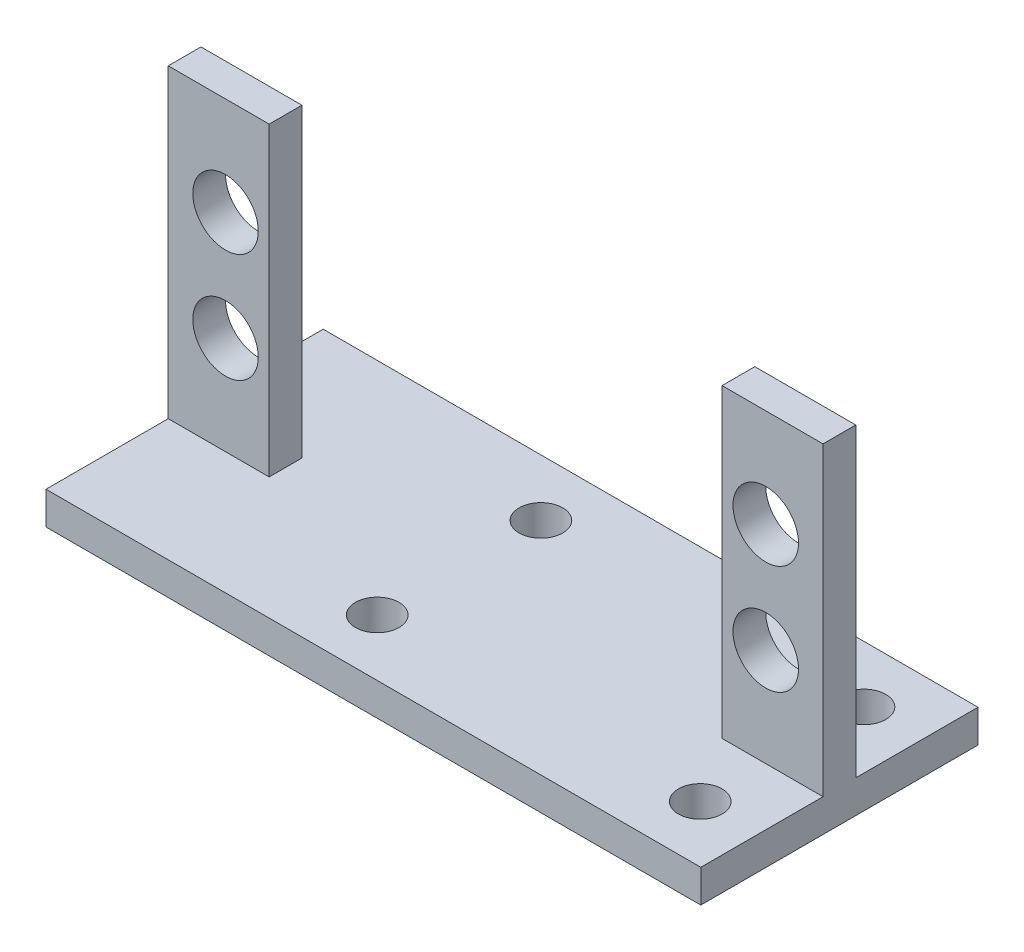
ISO-10303-21;
HEADER;
FILE_DESCRIPTION(('STEP AP214'),'2;1');
FILE_NAME('part.step','',(''),(''),'','','');
FILE_SCHEMA(('AUTOMOTIVE_DESIGN { 1 0 10303 214 1 1 1 1 }'));
ENDSEC;
DATA;
#1=APPLICATION_CONTEXT('core data for automotive mechanical design processes');
#2=APPLICATION_PROTOCOL_DEFINITION('international standard','automotive_design',2000,#1);
#3=PRODUCT_CONTEXT('',#1,'mechanical');
#4=PRODUCT('Part','Part','',(#3));
#5=PRODUCT_RELATED_PRODUCT_CATEGORY('part','',(#4));
#6=PRODUCT_DEFINITION_FORMATION('','',#4);
#7=PRODUCT_DEFINITION_CONTEXT('part definition',#1,'design');
#8=PRODUCT_DEFINITION('design','',#6,#7);
#9=PRODUCT_DEFINITION_SHAPE('','',#8);
#10=(LENGTH_UNIT() NAMED_UNIT(*) SI_UNIT(.MILLI.,.METRE.));
#11=(NAMED_UNIT(*) PLANE_ANGLE_UNIT() SI_UNIT($,.RADIAN.));
#12=(NAMED_UNIT(*) SI_UNIT($,.STERADIAN.) SOLID_ANGLE_UNIT());
#13=UNCERTAINTY_MEASURE_WITH_UNIT(LENGTH_MEASURE(1.E-05),#10,'distance_accuracy_value','');
#14=(GEOMETRIC_REPRESENTATION_CONTEXT(3) GLOBAL_UNCERTAINTY_ASSIGNED_CONTEXT((#13)) GLOBAL_UNIT_ASSIGNED_CONTEXT((#10,
#11,#12)) REPRESENTATION_CONTEXT('',''));
#15=CARTESIAN_POINT('',(0.,0.,0.));
#16=DIRECTION('',(0.,0.,1.));
#17=DIRECTION('',(1.,0.,0.));
#18=AXIS2_PLACEMENT_3D('',#15,#16,#17);
#19=CARTESIAN_POINT('',(-29.,3.,-12.7));
#20=DIRECTION('',(0.,0.,1.));
#21=DIRECTION('',(1.,0.,0.));
#22=AXIS2_PLACEMENT_3D('',#19,#20,#21);
#23=PLANE('',#22);
#24=DIRECTION('',(-1.,0.,0.));
#25=VECTOR('',#24,1.);
#26=CARTESIAN_POINT('',(-29.,0.,-12.7));
#27=LINE('',#26,#25);
#28=CARTESIAN_POINT('',(30.,0.,-12.7));
#29=VERTEX_POINT('',#28);
#30=CARTESIAN_POINT('',(-30.,0.,-12.7));
#31=VERTEX_POINT('',#30);
#32=EDGE_CURVE('E121',#29,#31,#27,.T.);
#33=ORIENTED_EDGE('',*,*,#32,.T.);
#34=DIRECTION('',(0.,-1.,0.));
#35=VECTOR('',#34,1.);
#36=CARTESIAN_POINT('',(-30.,0.,-12.7));
#37=LINE('',#36,#35);
#38=CARTESIAN_POINT('',(-30.,3.,-12.7));
#39=VERTEX_POINT('',#38);
#40=EDGE_CURVE('E204',#39,#31,#37,.T.);
#41=ORIENTED_EDGE('',*,*,#40,.F.);
#42=DIRECTION('',(-1.,0.,0.));
#43=VECTOR('',#42,1.);
#44=CARTESIAN_POINT('',(-29.,3.,-12.7));
#45=LINE('',#44,#43);
#46=CARTESIAN_POINT('',(30.,3.,-12.7));
#47=VERTEX_POINT('',#46);
#48=EDGE_CURVE('E48',#47,#39,#45,.T.);
#49=ORIENTED_EDGE('',*,*,#48,.F.);
#50=DIRECTION('',(0.,1.,0.));
#51=VECTOR('',#50,1.);
#52=CARTESIAN_POINT('',(30.,3.,-12.7));
#53=LINE('',#52,#51);
#54=EDGE_CURVE('E207',#29,#47,#53,.T.);
#55=ORIENTED_EDGE('',*,*,#54,.F.);
#56=EDGE_LOOP('',(#33,#41,#49,#55));
#57=FACE_BOUND('',#56,.T.);
#58=ADVANCED_FACE('F39',(#57),#23,.F.);
#59=CARTESIAN_POINT('',(0.,3.,0.));
#60=DIRECTION('',(0.,1.,0.));
#61=DIRECTION('',(0.,0.,1.));
#62=AXIS2_PLACEMENT_3D('',#59,#60,#61);
#63=PLANE('',#62);
#64=DIRECTION('',(0.,0.,-1.));
#65=VECTOR('',#64,1.);
#66=CARTESIAN_POINT('',(-20.75,3.,-1.5));
#67=LINE('',#66,#65);
#68=CARTESIAN_POINT('',(-20.75,3.,1.5));
#69=VERTEX_POINT('',#68);
#70=CARTESIAN_POINT('',(-20.75,3.,-1.5));
#71=VERTEX_POINT('',#70);
#72=EDGE_CURVE('E99',#69,#71,#67,.T.);
#73=ORIENTED_EDGE('',*,*,#72,.F.);
#74=DIRECTION('',(1.,0.,0.));
#75=VECTOR('',#74,1.);
#76=CARTESIAN_POINT('',(-20.75,3.,1.5));
#77=LINE('',#76,#75);
#78=CARTESIAN_POINT('',(-30.,3.,1.5));
#79=VERTEX_POINT('',#78);
#80=EDGE_CURVE('E79',#79,#69,#77,.T.);
#81=ORIENTED_EDGE('',*,*,#80,.F.);
#82=DIRECTION('',(0.,0.,-1.));
#83=VECTOR('',#82,1.);
#84=CARTESIAN_POINT('',(-30.,3.,1.5));
#85=LINE('',#84,#83);
#86=CARTESIAN_POINT('',(-30.,3.,12.7));
#87=VERTEX_POINT('',#86);
#88=EDGE_CURVE('E230',#87,#79,#85,.T.);
#89=ORIENTED_EDGE('',*,*,#88,.F.);
#90=DIRECTION('',(1.,0.,0.));
#91=VECTOR('',#90,1.);
#92=CARTESIAN_POINT('',(-29.,3.,12.7));
#93=LINE('',#92,#91);
#94=CARTESIAN_POINT('',(30.,3.,12.7));
#95=VERTEX_POINT('',#94);
#96=EDGE_CURVE('E11',#87,#95,#93,.T.);
#97=ORIENTED_EDGE('',*,*,#96,.T.);
#98=DIRECTION('',(0.,0.,1.));
#99=VECTOR('',#98,1.);
#100=CARTESIAN_POINT('',(30.,3.,12.7));
#101=LINE('',#100,#99);
#102=CARTESIAN_POINT('',(30.,3.,1.5));
#103=VERTEX_POINT('',#102);
#104=EDGE_CURVE('E269',#103,#95,#101,.T.);
#105=ORIENTED_EDGE('',*,*,#104,.F.);
#106=DIRECTION('',(1.,0.,0.));
#107=VECTOR('',#106,1.);
#108=CARTESIAN_POINT('',(20.75,3.,1.5));
#109=LINE('',#108,#107);
#110=CARTESIAN_POINT('',(20.75,3.,1.5));
#111=VERTEX_POINT('',#110);
#112=EDGE_CURVE('E299',#111,#103,#109,.T.);
#113=ORIENTED_EDGE('',*,*,#112,.F.);
#114=DIRECTION('',(0.,0.,1.));
#115=VECTOR('',#114,1.);
#116=CARTESIAN_POINT('',(20.75,3.,-1.5));
#117=LINE('',#116,#115);
#118=CARTESIAN_POINT('',(20.75,3.,-1.5));
#119=VERTEX_POINT('',#118);
#120=EDGE_CURVE('E305',#119,#111,#117,.T.);
#121=ORIENTED_EDGE('',*,*,#120,.F.);
#122=DIRECTION('',(-1.,0.,0.));
#123=VECTOR('',#122,1.);
#124=CARTESIAN_POINT('',(28.75,3.,-1.5));
#125=LINE('',#124,#123);
#126=CARTESIAN_POINT('',(30.,3.,-1.5));
#127=VERTEX_POINT('',#126);
#128=EDGE_CURVE('E56',#127,#119,#125,.T.);
#129=ORIENTED_EDGE('',*,*,#128,.F.);
#130=DIRECTION('',(0.,0.,1.));
#131=VECTOR('',#130,1.);
#132=CARTESIAN_POINT('',(30.,3.,-1.5));
#133=LINE('',#132,#131);
#134=EDGE_CURVE('E253',#47,#127,#133,.T.);
#135=ORIENTED_EDGE('',*,*,#134,.F.);
#136=ORIENTED_EDGE('',*,*,#48,.T.);
#137=DIRECTION('',(0.,0.,-1.));
#138=VECTOR('',#137,1.);
#139=CARTESIAN_POINT('',(-30.,3.,-12.7));
#140=LINE('',#139,#138);
#141=CARTESIAN_POINT('',(-30.,3.,-1.5));
#142=VERTEX_POINT('',#141);
#143=EDGE_CURVE('E224',#142,#39,#140,.T.);
#144=ORIENTED_EDGE('',*,*,#143,.F.);
#145=DIRECTION('',(-1.,0.,0.));
#146=VECTOR('',#145,1.);
#147=CARTESIAN_POINT('',(-28.75,3.,-1.5));
#148=LINE('',#147,#146);
#149=EDGE_CURVE('E93',#71,#142,#148,.T.);
#150=ORIENTED_EDGE('',*,*,#149,.F.);
#151=EDGE_LOOP('',(#73,#81,#89,#97,#105,#113,#121,#129,#135,#136,#144,#150));
#152=FACE_BOUND('',#151,.T.);
#153=CARTESIAN_POINT('',(-4.85,3.,7.5));
#154=DIRECTION('',(0.,1.,0.));
#155=DIRECTION('',(0.,0.,-1.));
#156=AXIS2_PLACEMENT_3D('',#153,#154,#155);
#157=CIRCLE('',#156,2.);
#158=CARTESIAN_POINT('',(-4.85,3.,5.5));
#159=VERTEX_POINT('',#158);
#160=EDGE_CURVE('E273',#159,#159,#157,.T.);
#161=ORIENTED_EDGE('',*,*,#160,.F.);
#162=EDGE_LOOP('',(#161));
#163=FACE_BOUND('',#162,.T.);
#164=CARTESIAN_POINT('',(24.75,3.,-7.5));
#165=DIRECTION('',(0.,1.,0.));
#166=DIRECTION('',(0.,0.,-1.));
#167=AXIS2_PLACEMENT_3D('',#164,#165,#166);
#168=CIRCLE('',#167,2.);
#169=CARTESIAN_POINT('',(24.75,3.,-9.5));
#170=VERTEX_POINT('',#169);
#171=EDGE_CURVE('E278',#170,#170,#168,.T.);
#172=ORIENTED_EDGE('',*,*,#171,.F.);
#173=EDGE_LOOP('',(#172));
#174=FACE_BOUND('',#173,.T.);
#175=CARTESIAN_POINT('',(24.75,3.,7.5));
#176=DIRECTION('',(0.,1.,0.));
#177=DIRECTION('',(0.,0.,1.));
#178=AXIS2_PLACEMENT_3D('',#175,#176,#177);
#179=CIRCLE('',#178,2.);
#180=CARTESIAN_POINT('',(24.75,3.,9.5));
#181=VERTEX_POINT('',#180);
#182=EDGE_CURVE('E274',#181,#181,#179,.T.);
#183=ORIENTED_EDGE('',*,*,#182,.F.);
#184=EDGE_LOOP('',(#183));
#185=FACE_BOUND('',#184,.T.);
#186=CARTESIAN_POINT('',(-4.85,3.,-7.5));
#187=DIRECTION('',(0.,1.,0.));
#188=DIRECTION('',(0.,0.,1.));
#189=AXIS2_PLACEMENT_3D('',#186,#187,#188);
#190=CIRCLE('',#189,2.);
#191=CARTESIAN_POINT('',(-4.85,3.,-5.5));
#192=VERTEX_POINT('',#191);
#193=EDGE_CURVE('E157',#192,#192,#190,.T.);
#194=ORIENTED_EDGE('',*,*,#193,.F.);
#195=EDGE_LOOP('',(#194));
#196=FACE_BOUND('',#195,.T.);
#197=ADVANCED_FACE('F104',(#152,#163,#174,#185,#196),#63,.T.);
#198=CARTESIAN_POINT('',(-29.,3.,12.7));
#199=DIRECTION('',(0.,0.,-1.));
#200=DIRECTION('',(-1.,0.,0.));
#201=AXIS2_PLACEMENT_3D('',#198,#199,#200);
#202=PLANE('',#201);
#203=DIRECTION('',(0.,-1.,0.));
#204=VECTOR('',#203,1.);
#205=CARTESIAN_POINT('',(30.,0.,12.7));
#206=LINE('',#205,#204);
#207=CARTESIAN_POINT('',(30.,0.,12.7));
#208=VERTEX_POINT('',#207);
#209=EDGE_CURVE('E244',#95,#208,#206,.T.);
#210=ORIENTED_EDGE('',*,*,#209,.F.);
#211=ORIENTED_EDGE('',*,*,#96,.F.);
#212=DIRECTION('',(0.,1.,0.));
#213=VECTOR('',#212,1.);
#214=CARTESIAN_POINT('',(-30.,3.,12.7));
#215=LINE('',#214,#213);
#216=CARTESIAN_POINT('',(-30.,0.,12.7));
#217=VERTEX_POINT('',#216);
#218=EDGE_CURVE('E220',#217,#87,#215,.T.);
#219=ORIENTED_EDGE('',*,*,#218,.F.);
#220=DIRECTION('',(1.,0.,0.));
#221=VECTOR('',#220,1.);
#222=CARTESIAN_POINT('',(-29.,0.,12.7));
#223=LINE('',#222,#221);
#224=EDGE_CURVE('E124',#217,#208,#223,.T.);
#225=ORIENTED_EDGE('',*,*,#224,.T.);
#226=EDGE_LOOP('',(#210,#211,#219,#225));
#227=FACE_BOUND('',#226,.T.);
#228=ADVANCED_FACE('F194',(#227),#202,.F.);
#229=CARTESIAN_POINT('',(0.,0.,0.));
#230=DIRECTION('',(0.,1.,0.));
#231=DIRECTION('',(0.,0.,1.));
#232=AXIS2_PLACEMENT_3D('',#229,#230,#231);
#233=PLANE('',#232);
#234=CARTESIAN_POINT('',(-4.85,0.,7.5));
#235=DIRECTION('',(0.,1.,0.));
#236=DIRECTION('',(0.,0.,1.));
#237=AXIS2_PLACEMENT_3D('',#234,#235,#236);
#238=CIRCLE('',#237,2.);
#239=CARTESIAN_POINT('',(-4.85,0.,9.5));
#240=VERTEX_POINT('',#239);
#241=EDGE_CURVE('E42',#240,#240,#238,.T.);
#242=ORIENTED_EDGE('',*,*,#241,.T.);
#243=EDGE_LOOP('',(#242));
#244=FACE_BOUND('',#243,.T.);
#245=CARTESIAN_POINT('',(24.75,0.,-7.5));
#246=DIRECTION('',(0.,1.,0.));
#247=DIRECTION('',(0.,0.,1.));
#248=AXIS2_PLACEMENT_3D('',#245,#246,#247);
#249=CIRCLE('',#248,2.);
#250=CARTESIAN_POINT('',(24.75,0.,-5.5));
#251=VERTEX_POINT('',#250);
#252=EDGE_CURVE('E160',#251,#251,#249,.T.);
#253=ORIENTED_EDGE('',*,*,#252,.T.);
#254=EDGE_LOOP('',(#253));
#255=FACE_BOUND('',#254,.T.);
#256=CARTESIAN_POINT('',(24.75,0.,7.5));
#257=DIRECTION('',(0.,1.,0.));
#258=DIRECTION('',(0.,0.,1.));
#259=AXIS2_PLACEMENT_3D('',#256,#257,#258);
#260=CIRCLE('',#259,2.);
#261=CARTESIAN_POINT('',(24.75,0.,9.5));
#262=VERTEX_POINT('',#261);
#263=EDGE_CURVE('E156',#262,#262,#260,.T.);
#264=ORIENTED_EDGE('',*,*,#263,.T.);
#265=EDGE_LOOP('',(#264));
#266=FACE_BOUND('',#265,.T.);
#267=CARTESIAN_POINT('',(-4.85,0.,-7.5));
#268=DIRECTION('',(0.,1.,0.));
#269=DIRECTION('',(0.,0.,1.));
#270=AXIS2_PLACEMENT_3D('',#267,#268,#269);
#271=CIRCLE('',#270,2.);
#272=CARTESIAN_POINT('',(-4.85,0.,-5.5));
#273=VERTEX_POINT('',#272);
#274=EDGE_CURVE('E152',#273,#273,#271,.T.);
#275=ORIENTED_EDGE('',*,*,#274,.T.);
#276=EDGE_LOOP('',(#275));
#277=FACE_BOUND('',#276,.T.);
#278=DIRECTION('',(0.,0.,-1.));
#279=VECTOR('',#278,1.);
#280=CARTESIAN_POINT('',(30.,0.,-12.7));
#281=LINE('',#280,#279);
#282=EDGE_CURVE('E248',#208,#29,#281,.T.);
#283=ORIENTED_EDGE('',*,*,#282,.F.);
#284=ORIENTED_EDGE('',*,*,#224,.F.);
#285=DIRECTION('',(0.,0.,1.));
#286=VECTOR('',#285,1.);
#287=CARTESIAN_POINT('',(-30.,0.,12.7));
#288=LINE('',#287,#286);
#289=EDGE_CURVE('E215',#31,#217,#288,.T.);
#290=ORIENTED_EDGE('',*,*,#289,.F.);
#291=ORIENTED_EDGE('',*,*,#32,.F.);
#292=EDGE_LOOP('',(#283,#284,#290,#291));
#293=FACE_BOUND('',#292,.T.);
#294=ADVANCED_FACE('F169',(#244,#255,#266,#277,#293),#233,.F.);
#295=CARTESIAN_POINT('',(-20.75,31.,-1.5));
#296=DIRECTION('',(-1.,0.,0.));
#297=DIRECTION('',(0.,0.,1.));
#298=AXIS2_PLACEMENT_3D('',#295,#296,#297);
#299=PLANE('',#298);
#300=ORIENTED_EDGE('',*,*,#72,.T.);
#301=DIRECTION('',(0.,-1.,0.));
#302=VECTOR('',#301,1.);
#303=CARTESIAN_POINT('',(-20.75,31.,-1.5));
#304=LINE('',#303,#302);
#305=CARTESIAN_POINT('',(-20.75,31.,-1.5));
#306=VERTEX_POINT('',#305);
#307=EDGE_CURVE('E102',#306,#71,#304,.T.);
#308=ORIENTED_EDGE('',*,*,#307,.F.);
#309=DIRECTION('',(0.,0.,-1.));
#310=VECTOR('',#309,1.);
#311=CARTESIAN_POINT('',(-20.75,31.,-1.5));
#312=LINE('',#311,#310);
#313=CARTESIAN_POINT('',(-20.75,31.,1.5));
#314=VERTEX_POINT('',#313);
#315=EDGE_CURVE('E92',#314,#306,#312,.T.);
#316=ORIENTED_EDGE('',*,*,#315,.F.);
#317=DIRECTION('',(0.,-1.,0.));
#318=VECTOR('',#317,1.);
#319=CARTESIAN_POINT('',(-20.75,31.,1.5));
#320=LINE('',#319,#318);
#321=EDGE_CURVE('E82',#314,#69,#320,.T.);
#322=ORIENTED_EDGE('',*,*,#321,.T.);
#323=EDGE_LOOP('',(#300,#308,#316,#322));
#324=FACE_BOUND('',#323,.T.);
#325=ADVANCED_FACE('F97',(#324),#299,.F.);
#326=CARTESIAN_POINT('',(-28.75,31.,-1.5));
#327=DIRECTION('',(0.,0.,1.));
#328=DIRECTION('',(1.,0.,0.));
#329=AXIS2_PLACEMENT_3D('',#326,#327,#328);
#330=PLANE('',#329);
#331=CARTESIAN_POINT('',(-24.75,22.,-1.5));
#332=DIRECTION('',(0.,0.,1.));
#333=DIRECTION('',(1.,0.,0.));
#334=AXIS2_PLACEMENT_3D('',#331,#332,#333);
#335=CIRCLE('',#334,3.);
#336=CARTESIAN_POINT('',(-21.75,22.,-1.5));
#337=VERTEX_POINT('',#336);
#338=EDGE_CURVE('E151',#337,#337,#335,.T.);
#339=ORIENTED_EDGE('',*,*,#338,.T.);
#340=EDGE_LOOP('',(#339));
#341=FACE_BOUND('',#340,.T.);
#342=CARTESIAN_POINT('',(-24.75,12.,-1.5));
#343=DIRECTION('',(0.,0.,1.));
#344=DIRECTION('',(1.,0.,0.));
#345=AXIS2_PLACEMENT_3D('',#342,#343,#344);
#346=CIRCLE('',#345,3.);
#347=CARTESIAN_POINT('',(-21.75,12.,-1.5));
#348=VERTEX_POINT('',#347);
#349=EDGE_CURVE('E146',#348,#348,#346,.T.);
#350=ORIENTED_EDGE('',*,*,#349,.T.);
#351=EDGE_LOOP('',(#350));
#352=FACE_BOUND('',#351,.T.);
#353=ORIENTED_EDGE('',*,*,#149,.T.);
#354=DIRECTION('',(0.,-1.,0.));
#355=VECTOR('',#354,1.);
#356=CARTESIAN_POINT('',(-30.,3.,-1.5));
#357=LINE('',#356,#355);
#358=CARTESIAN_POINT('',(-30.,31.,-1.5));
#359=VERTEX_POINT('',#358);
#360=EDGE_CURVE('E239',#359,#142,#357,.T.);
#361=ORIENTED_EDGE('',*,*,#360,.F.);
#362=DIRECTION('',(-1.,0.,0.));
#363=VECTOR('',#362,1.);
#364=CARTESIAN_POINT('',(-28.75,31.,-1.5));
#365=LINE('',#364,#363);
#366=EDGE_CURVE('E325',#306,#359,#365,.T.);
#367=ORIENTED_EDGE('',*,*,#366,.F.);
#368=ORIENTED_EDGE('',*,*,#307,.T.);
#369=EDGE_LOOP('',(#353,#361,#367,#368));
#370=FACE_BOUND('',#369,.T.);
#371=ADVANCED_FACE('F336',(#341,#352,#370),#330,.F.);
#372=CARTESIAN_POINT('',(-20.75,31.,1.5));
#373=DIRECTION('',(0.,0.,-1.));
#374=DIRECTION('',(-1.,0.,0.));
#375=AXIS2_PLACEMENT_3D('',#372,#373,#374);
#376=PLANE('',#375);
#377=CARTESIAN_POINT('',(-24.75,22.,1.5));
#378=DIRECTION('',(0.,0.,-1.));
#379=DIRECTION('',(-1.,0.,0.));
#380=AXIS2_PLACEMENT_3D('',#377,#378,#379);
#381=CIRCLE('',#380,3.);
#382=CARTESIAN_POINT('',(-27.75,22.,1.5));
#383=VERTEX_POINT('',#382);
#384=EDGE_CURVE('E147',#383,#383,#381,.T.);
#385=ORIENTED_EDGE('',*,*,#384,.T.);
#386=EDGE_LOOP('',(#385));
#387=FACE_BOUND('',#386,.T.);
#388=CARTESIAN_POINT('',(-24.75,12.,1.5));
#389=DIRECTION('',(0.,0.,-1.));
#390=DIRECTION('',(-1.,0.,0.));
#391=AXIS2_PLACEMENT_3D('',#388,#389,#390);
#392=CIRCLE('',#391,3.);
#393=CARTESIAN_POINT('',(-27.75,12.,1.5));
#394=VERTEX_POINT('',#393);
#395=EDGE_CURVE('E142',#394,#394,#392,.T.);
#396=ORIENTED_EDGE('',*,*,#395,.T.);
#397=EDGE_LOOP('',(#396));
#398=FACE_BOUND('',#397,.T.);
#399=ORIENTED_EDGE('',*,*,#321,.F.);
#400=DIRECTION('',(1.,0.,0.));
#401=VECTOR('',#400,1.);
#402=CARTESIAN_POINT('',(-20.75,31.,1.5));
#403=LINE('',#402,#401);
#404=CARTESIAN_POINT('',(-30.,31.,1.5));
#405=VERTEX_POINT('',#404);
#406=EDGE_CURVE('E65',#405,#314,#403,.T.);
#407=ORIENTED_EDGE('',*,*,#406,.F.);
#408=DIRECTION('',(0.,1.,0.));
#409=VECTOR('',#408,1.);
#410=CARTESIAN_POINT('',(-30.,31.,1.5));
#411=LINE('',#410,#409);
#412=EDGE_CURVE('E86',#79,#405,#411,.T.);
#413=ORIENTED_EDGE('',*,*,#412,.F.);
#414=ORIENTED_EDGE('',*,*,#80,.T.);
#415=EDGE_LOOP('',(#399,#407,#413,#414));
#416=FACE_BOUND('',#415,.T.);
#417=ADVANCED_FACE('F81',(#387,#398,#416),#376,.F.);
#418=CARTESIAN_POINT('',(0.,31.,0.));
#419=DIRECTION('',(0.,-1.,0.));
#420=DIRECTION('',(0.,0.,-1.));
#421=AXIS2_PLACEMENT_3D('',#418,#419,#420);
#422=PLANE('',#421);
#423=ORIENTED_EDGE('',*,*,#366,.T.);
#424=DIRECTION('',(0.,0.,-1.));
#425=VECTOR('',#424,1.);
#426=CARTESIAN_POINT('',(-30.,31.,-1.5));
#427=LINE('',#426,#425);
#428=EDGE_CURVE('E235',#405,#359,#427,.T.);
#429=ORIENTED_EDGE('',*,*,#428,.F.);
#430=ORIENTED_EDGE('',*,*,#406,.T.);
#431=ORIENTED_EDGE('',*,*,#315,.T.);
#432=EDGE_LOOP('',(#423,#429,#430,#431));
#433=FACE_BOUND('',#432,.T.);
#434=ADVANCED_FACE('F330',(#433),#422,.F.);
#435=CARTESIAN_POINT('',(20.75,31.,1.5));
#436=DIRECTION('',(0.,0.,-1.));
#437=DIRECTION('',(-1.,0.,0.));
#438=AXIS2_PLACEMENT_3D('',#435,#436,#437);
#439=PLANE('',#438);
#440=CARTESIAN_POINT('',(24.75,12.,1.5));
#441=DIRECTION('',(0.,0.,-1.));
#442=DIRECTION('',(-1.,0.,0.));
#443=AXIS2_PLACEMENT_3D('',#440,#441,#442);
#444=CIRCLE('',#443,3.);
#445=CARTESIAN_POINT('',(21.75,12.,1.5));
#446=VERTEX_POINT('',#445);
#447=EDGE_CURVE('E141',#446,#446,#444,.T.);
#448=ORIENTED_EDGE('',*,*,#447,.T.);
#449=EDGE_LOOP('',(#448));
#450=FACE_BOUND('',#449,.T.);
#451=CARTESIAN_POINT('',(24.75,22.,1.5));
#452=DIRECTION('',(0.,0.,-1.));
#453=DIRECTION('',(-1.,0.,0.));
#454=AXIS2_PLACEMENT_3D('',#451,#452,#453);
#455=CIRCLE('',#454,3.);
#456=CARTESIAN_POINT('',(21.75,22.,1.5));
#457=VERTEX_POINT('',#456);
#458=EDGE_CURVE('E136',#457,#457,#455,.T.);
#459=ORIENTED_EDGE('',*,*,#458,.T.);
#460=EDGE_LOOP('',(#459));
#461=FACE_BOUND('',#460,.T.);
#462=ORIENTED_EDGE('',*,*,#112,.T.);
#463=DIRECTION('',(0.,-1.,0.));
#464=VECTOR('',#463,1.);
#465=CARTESIAN_POINT('',(30.,3.,1.5));
#466=LINE('',#465,#464);
#467=CARTESIAN_POINT('',(30.,31.,1.5));
#468=VERTEX_POINT('',#467);
#469=EDGE_CURVE('E265',#468,#103,#466,.T.);
#470=ORIENTED_EDGE('',*,*,#469,.F.);
#471=DIRECTION('',(1.,0.,0.));
#472=VECTOR('',#471,1.);
#473=CARTESIAN_POINT('',(20.75,31.,1.5));
#474=LINE('',#473,#472);
#475=CARTESIAN_POINT('',(20.75,31.,1.5));
#476=VERTEX_POINT('',#475);
#477=EDGE_CURVE('E300',#476,#468,#474,.T.);
#478=ORIENTED_EDGE('',*,*,#477,.F.);
#479=DIRECTION('',(0.,-1.,0.));
#480=VECTOR('',#479,1.);
#481=CARTESIAN_POINT('',(20.75,31.,1.5));
#482=LINE('',#481,#480);
#483=EDGE_CURVE('E114',#476,#111,#482,.T.);
#484=ORIENTED_EDGE('',*,*,#483,.T.);
#485=EDGE_LOOP('',(#462,#470,#478,#484));
#486=FACE_BOUND('',#485,.T.);
#487=ADVANCED_FACE('F368',(#450,#461,#486),#439,.F.);
#488=CARTESIAN_POINT('',(28.75,31.,-1.5));
#489=DIRECTION('',(0.,0.,1.));
#490=DIRECTION('',(1.,0.,0.));
#491=AXIS2_PLACEMENT_3D('',#488,#489,#490);
#492=PLANE('',#491);
#493=CARTESIAN_POINT('',(24.75,12.,-1.5));
#494=DIRECTION('',(0.,0.,1.));
#495=DIRECTION('',(1.,0.,0.));
#496=AXIS2_PLACEMENT_3D('',#493,#494,#495);
#497=CIRCLE('',#496,3.);
#498=CARTESIAN_POINT('',(27.75,12.,-1.5));
#499=VERTEX_POINT('',#498);
#500=EDGE_CURVE('E137',#499,#499,#497,.T.);
#501=ORIENTED_EDGE('',*,*,#500,.T.);
#502=EDGE_LOOP('',(#501));
#503=FACE_BOUND('',#502,.T.);
#504=CARTESIAN_POINT('',(24.75,22.,-1.5));
#505=DIRECTION('',(0.,0.,1.));
#506=DIRECTION('',(1.,0.,0.));
#507=AXIS2_PLACEMENT_3D('',#504,#505,#506);
#508=CIRCLE('',#507,3.);
#509=CARTESIAN_POINT('',(27.75,22.,-1.5));
#510=VERTEX_POINT('',#509);
#511=EDGE_CURVE('E132',#510,#510,#508,.T.);
#512=ORIENTED_EDGE('',*,*,#511,.T.);
#513=EDGE_LOOP('',(#512));
#514=FACE_BOUND('',#513,.T.);
#515=DIRECTION('',(0.,-1.,0.));
#516=VECTOR('',#515,1.);
#517=CARTESIAN_POINT('',(20.75,31.,-1.5));
#518=LINE('',#517,#516);
#519=CARTESIAN_POINT('',(20.75,31.,-1.5));
#520=VERTEX_POINT('',#519);
#521=EDGE_CURVE('E109',#520,#119,#518,.T.);
#522=ORIENTED_EDGE('',*,*,#521,.F.);
#523=DIRECTION('',(-1.,0.,0.));
#524=VECTOR('',#523,1.);
#525=CARTESIAN_POINT('',(28.75,31.,-1.5));
#526=LINE('',#525,#524);
#527=CARTESIAN_POINT('',(30.,31.,-1.5));
#528=VERTEX_POINT('',#527);
#529=EDGE_CURVE('E304',#528,#520,#526,.T.);
#530=ORIENTED_EDGE('',*,*,#529,.F.);
#531=DIRECTION('',(0.,1.,0.));
#532=VECTOR('',#531,1.);
#533=CARTESIAN_POINT('',(30.,31.,-1.5));
#534=LINE('',#533,#532);
#535=EDGE_CURVE('E257',#127,#528,#534,.T.);
#536=ORIENTED_EDGE('',*,*,#535,.F.);
#537=ORIENTED_EDGE('',*,*,#128,.T.);
#538=EDGE_LOOP('',(#522,#530,#536,#537));
#539=FACE_BOUND('',#538,.T.);
#540=ADVANCED_FACE('F377',(#503,#514,#539),#492,.F.);
#541=CARTESIAN_POINT('',(20.75,31.,-1.5));
#542=DIRECTION('',(1.,0.,0.));
#543=DIRECTION('',(0.,0.,-1.));
#544=AXIS2_PLACEMENT_3D('',#541,#542,#543);
#545=PLANE('',#544);
#546=ORIENTED_EDGE('',*,*,#120,.T.);
#547=ORIENTED_EDGE('',*,*,#483,.F.);
#548=DIRECTION('',(0.,0.,1.));
#549=VECTOR('',#548,1.);
#550=CARTESIAN_POINT('',(20.75,31.,-1.5));
#551=LINE('',#550,#549);
#552=EDGE_CURVE('E309',#520,#476,#551,.T.);
#553=ORIENTED_EDGE('',*,*,#552,.F.);
#554=ORIENTED_EDGE('',*,*,#521,.T.);
#555=EDGE_LOOP('',(#546,#547,#553,#554));
#556=FACE_BOUND('',#555,.T.);
#557=ADVANCED_FACE('F363',(#556),#545,.F.);
#558=CARTESIAN_POINT('',(0.,31.,0.));
#559=DIRECTION('',(0.,1.,0.));
#560=DIRECTION('',(0.,0.,1.));
#561=AXIS2_PLACEMENT_3D('',#558,#559,#560);
#562=PLANE('',#561);
#563=ORIENTED_EDGE('',*,*,#477,.T.);
#564=DIRECTION('',(0.,0.,1.));
#565=VECTOR('',#564,1.);
#566=CARTESIAN_POINT('',(30.,31.,1.5));
#567=LINE('',#566,#565);
#568=EDGE_CURVE('E261',#528,#468,#567,.T.);
#569=ORIENTED_EDGE('',*,*,#568,.F.);
#570=ORIENTED_EDGE('',*,*,#529,.T.);
#571=ORIENTED_EDGE('',*,*,#552,.T.);
#572=EDGE_LOOP('',(#563,#569,#570,#571));
#573=FACE_BOUND('',#572,.T.);
#574=ADVANCED_FACE('F379',(#573),#562,.T.);
#575=CARTESIAN_POINT('',(24.75,22.,-21.7));
#576=DIRECTION('',(0.,0.,1.));
#577=DIRECTION('',(1.,0.,0.));
#578=AXIS2_PLACEMENT_3D('',#575,#576,#577);
#579=CYLINDRICAL_SURFACE('',#578,3.);
#580=ORIENTED_EDGE('',*,*,#511,.F.);
#581=EDGE_LOOP('',(#580));
#582=FACE_BOUND('',#581,.T.);
#583=ORIENTED_EDGE('',*,*,#458,.F.);
#584=EDGE_LOOP('',(#583));
#585=FACE_BOUND('',#584,.T.);
#586=ADVANCED_FACE('F381',(#582,#585),#579,.F.);
#587=CARTESIAN_POINT('',(24.75,12.,-21.7));
#588=DIRECTION('',(0.,0.,1.));
#589=DIRECTION('',(1.,0.,0.));
#590=AXIS2_PLACEMENT_3D('',#587,#588,#589);
#591=CYLINDRICAL_SURFACE('',#590,3.);
#592=ORIENTED_EDGE('',*,*,#500,.F.);
#593=EDGE_LOOP('',(#592));
#594=FACE_BOUND('',#593,.T.);
#595=ORIENTED_EDGE('',*,*,#447,.F.);
#596=EDGE_LOOP('',(#595));
#597=FACE_BOUND('',#596,.T.);
#598=ADVANCED_FACE('F387',(#594,#597),#591,.F.);
#599=CARTESIAN_POINT('',(-24.75,12.,-21.7));
#600=DIRECTION('',(0.,0.,1.));
#601=DIRECTION('',(1.,0.,0.));
#602=AXIS2_PLACEMENT_3D('',#599,#600,#601);
#603=CYLINDRICAL_SURFACE('',#602,3.);
#604=ORIENTED_EDGE('',*,*,#395,.F.);
#605=EDGE_LOOP('',(#604));
#606=FACE_BOUND('',#605,.T.);
#607=ORIENTED_EDGE('',*,*,#349,.F.);
#608=EDGE_LOOP('',(#607));
#609=FACE_BOUND('',#608,.T.);
#610=ADVANCED_FACE('F393',(#606,#609),#603,.F.);
#611=CARTESIAN_POINT('',(-24.75,22.,-21.7));
#612=DIRECTION('',(0.,0.,1.));
#613=DIRECTION('',(1.,0.,0.));
#614=AXIS2_PLACEMENT_3D('',#611,#612,#613);
#615=CYLINDRICAL_SURFACE('',#614,3.);
#616=ORIENTED_EDGE('',*,*,#384,.F.);
#617=EDGE_LOOP('',(#616));
#618=FACE_BOUND('',#617,.T.);
#619=ORIENTED_EDGE('',*,*,#338,.F.);
#620=EDGE_LOOP('',(#619));
#621=FACE_BOUND('',#620,.T.);
#622=ADVANCED_FACE('F514',(#618,#621),#615,.F.);
#623=CARTESIAN_POINT('',(-4.85,-19.,-7.5));
#624=DIRECTION('',(0.,1.,0.));
#625=DIRECTION('',(0.,0.,1.));
#626=AXIS2_PLACEMENT_3D('',#623,#624,#625);
#627=CYLINDRICAL_SURFACE('',#626,2.);
#628=ORIENTED_EDGE('',*,*,#193,.T.);
#629=EDGE_LOOP('',(#628));
#630=FACE_BOUND('',#629,.T.);
#631=ORIENTED_EDGE('',*,*,#274,.F.);
#632=EDGE_LOOP('',(#631));
#633=FACE_BOUND('',#632,.T.);
#634=ADVANCED_FACE('F509',(#630,#633),#627,.F.);
#635=CARTESIAN_POINT('',(24.75,-19.,7.5));
#636=DIRECTION('',(0.,1.,0.));
#637=DIRECTION('',(0.,0.,1.));
#638=AXIS2_PLACEMENT_3D('',#635,#636,#637);
#639=CYLINDRICAL_SURFACE('',#638,2.);
#640=ORIENTED_EDGE('',*,*,#182,.T.);
#641=EDGE_LOOP('',(#640));
#642=FACE_BOUND('',#641,.T.);
#643=ORIENTED_EDGE('',*,*,#263,.F.);
#644=EDGE_LOOP('',(#643));
#645=FACE_BOUND('',#644,.T.);
#646=ADVANCED_FACE('F185',(#642,#645),#639,.F.);
#647=CARTESIAN_POINT('',(24.75,-19.,-7.5));
#648=DIRECTION('',(0.,1.,0.));
#649=DIRECTION('',(0.,0.,1.));
#650=AXIS2_PLACEMENT_3D('',#647,#648,#649);
#651=CYLINDRICAL_SURFACE('',#650,2.);
#652=ORIENTED_EDGE('',*,*,#171,.T.);
#653=EDGE_LOOP('',(#652));
#654=FACE_BOUND('',#653,.T.);
#655=ORIENTED_EDGE('',*,*,#252,.F.);
#656=EDGE_LOOP('',(#655));
#657=FACE_BOUND('',#656,.T.);
#658=ADVANCED_FACE('F174',(#654,#657),#651,.F.);
#659=CARTESIAN_POINT('',(-4.85,-19.,7.5));
#660=DIRECTION('',(0.,1.,0.));
#661=DIRECTION('',(0.,0.,1.));
#662=AXIS2_PLACEMENT_3D('',#659,#660,#661);
#663=CYLINDRICAL_SURFACE('',#662,2.);
#664=ORIENTED_EDGE('',*,*,#160,.T.);
#665=EDGE_LOOP('',(#664));
#666=FACE_BOUND('',#665,.T.);
#667=ORIENTED_EDGE('',*,*,#241,.F.);
#668=EDGE_LOOP('',(#667));
#669=FACE_BOUND('',#668,.T.);
#670=ADVANCED_FACE('F171',(#666,#669),#663,.F.);
#671=CARTESIAN_POINT('',(30.,0.,0.));
#672=DIRECTION('',(-1.,0.,0.));
#673=DIRECTION('',(0.,0.,1.));
#674=AXIS2_PLACEMENT_3D('',#671,#672,#673);
#675=PLANE('',#674);
#676=ORIENTED_EDGE('',*,*,#209,.T.);
#677=ORIENTED_EDGE('',*,*,#282,.T.);
#678=ORIENTED_EDGE('',*,*,#54,.T.);
#679=ORIENTED_EDGE('',*,*,#134,.T.);
#680=ORIENTED_EDGE('',*,*,#535,.T.);
#681=ORIENTED_EDGE('',*,*,#568,.T.);
#682=ORIENTED_EDGE('',*,*,#469,.T.);
#683=ORIENTED_EDGE('',*,*,#104,.T.);
#684=EDGE_LOOP('',(#676,#677,#678,#679,#680,#681,#682,#683));
#685=FACE_BOUND('',#684,.T.);
#686=ADVANCED_FACE('F173',(#685),#675,.F.);
#687=CARTESIAN_POINT('',(-30.,0.,0.));
#688=DIRECTION('',(1.,0.,0.));
#689=DIRECTION('',(0.,0.,-1.));
#690=AXIS2_PLACEMENT_3D('',#687,#688,#689);
#691=PLANE('',#690);
#692=ORIENTED_EDGE('',*,*,#40,.T.);
#693=ORIENTED_EDGE('',*,*,#289,.T.);
#694=ORIENTED_EDGE('',*,*,#218,.T.);
#695=ORIENTED_EDGE('',*,*,#88,.T.);
#696=ORIENTED_EDGE('',*,*,#412,.T.);
#697=ORIENTED_EDGE('',*,*,#428,.T.);
#698=ORIENTED_EDGE('',*,*,#360,.T.);
#699=ORIENTED_EDGE('',*,*,#143,.T.);
#700=EDGE_LOOP('',(#692,#693,#694,#695,#696,#697,#698,#699));
#701=FACE_BOUND('',#700,.T.);
#702=ADVANCED_FACE('F182',(#701),#691,.F.);
#703=CLOSED_SHELL('',(#58,#197,#228,#294,#325,#371,#417,#434,#487,#540,#557,#574,#586,#598,#610,
#622,#634,#646,#658,#670,#686,#702));
#704=MANIFOLD_SOLID_BREP('B2',#703);
#705=ADVANCED_BREP_SHAPE_REPRESENTATION('',(#18,#704),#14);
#706=SHAPE_DEFINITION_REPRESENTATION(#9,#705);
ENDSEC;
END-ISO-10303-21;
